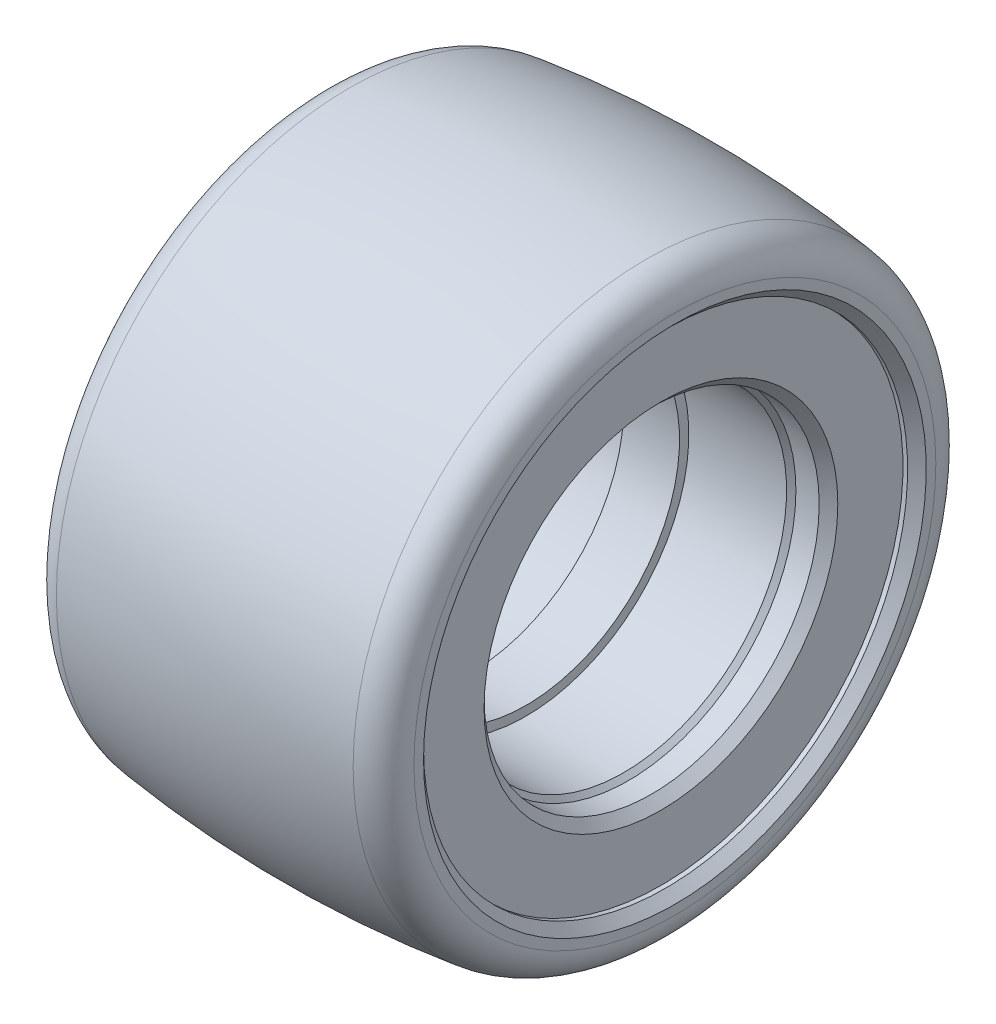
ISO-10303-21;
HEADER;
FILE_DESCRIPTION(('STEP AP214'),'2;1');
FILE_NAME('part.step','',(''),(''),'','','');
FILE_SCHEMA(('AUTOMOTIVE_DESIGN { 1 0 10303 214 1 1 1 1 }'));
ENDSEC;
DATA;
#1=APPLICATION_CONTEXT('core data for automotive mechanical design processes');
#2=APPLICATION_PROTOCOL_DEFINITION('international standard','automotive_design',2000,#1);
#3=PRODUCT_CONTEXT('',#1,'mechanical');
#4=PRODUCT('Part','Part','',(#3));
#5=PRODUCT_RELATED_PRODUCT_CATEGORY('part','',(#4));
#6=PRODUCT_DEFINITION_FORMATION('','',#4);
#7=PRODUCT_DEFINITION_CONTEXT('part definition',#1,'design');
#8=PRODUCT_DEFINITION('design','',#6,#7);
#9=PRODUCT_DEFINITION_SHAPE('','',#8);
#10=(LENGTH_UNIT() NAMED_UNIT(*) SI_UNIT(.MILLI.,.METRE.));
#11=(NAMED_UNIT(*) PLANE_ANGLE_UNIT() SI_UNIT($,.RADIAN.));
#12=(NAMED_UNIT(*) SI_UNIT($,.STERADIAN.) SOLID_ANGLE_UNIT());
#13=UNCERTAINTY_MEASURE_WITH_UNIT(LENGTH_MEASURE(1.E-05),#10,'distance_accuracy_value','');
#14=(GEOMETRIC_REPRESENTATION_CONTEXT(3) GLOBAL_UNCERTAINTY_ASSIGNED_CONTEXT((#13)) GLOBAL_UNIT_ASSIGNED_CONTEXT((#10,
#11,#12)) REPRESENTATION_CONTEXT('',''));
#15=CARTESIAN_POINT('',(0.,0.,0.));
#16=DIRECTION('',(0.,0.,1.));
#17=DIRECTION('',(1.,0.,0.));
#18=AXIS2_PLACEMENT_3D('',#15,#16,#17);
#19=CARTESIAN_POINT('',(19.,0.,0.));
#20=DIRECTION('',(-1.,0.,0.));
#21=DIRECTION('',(0.,0.,1.));
#22=AXIS2_PLACEMENT_3D('',#19,#20,#21);
#23=PLANE('',#22);
#24=CARTESIAN_POINT('',(19.,0.,0.));
#25=DIRECTION('',(-1.,0.,0.));
#26=DIRECTION('',(0.,0.,1.));
#27=AXIS2_PLACEMENT_3D('',#24,#25,#26);
#28=CIRCLE('',#27,28.0274359645035);
#29=CARTESIAN_POINT('',(19.,0.,28.0274359645035));
#30=VERTEX_POINT('',#29);
#31=EDGE_CURVE('E10',#30,#30,#28,.F.);
#32=ORIENTED_EDGE('',*,*,#31,.T.);
#33=EDGE_LOOP('',(#32));
#34=FACE_BOUND('',#33,.T.);
#35=CARTESIAN_POINT('',(19.,0.,0.));
#36=DIRECTION('',(-1.,0.,0.));
#37=DIRECTION('',(0.,0.,1.));
#38=AXIS2_PLACEMENT_3D('',#35,#36,#37);
#39=CIRCLE('',#38,27.);
#40=CARTESIAN_POINT('',(19.,0.,27.));
#41=VERTEX_POINT('',#40);
#42=EDGE_CURVE('E63',#41,#41,#39,.T.);
#43=ORIENTED_EDGE('',*,*,#42,.T.);
#44=EDGE_LOOP('',(#43));
#45=FACE_BOUND('',#44,.T.);
#46=ADVANCED_FACE('F34',(#34,#45),#23,.F.);
#47=CARTESIAN_POINT('',(-19.,0.,0.));
#48=DIRECTION('',(-1.,0.,0.));
#49=DIRECTION('',(0.,0.,1.));
#50=AXIS2_PLACEMENT_3D('',#47,#48,#49);
#51=PLANE('',#50);
#52=CARTESIAN_POINT('',(-19.,0.,0.));
#53=DIRECTION('',(-1.,0.,0.));
#54=DIRECTION('',(0.,0.,1.));
#55=AXIS2_PLACEMENT_3D('',#52,#53,#54);
#56=CIRCLE('',#55,28.0274359645035);
#57=CARTESIAN_POINT('',(-19.,0.,28.0274359645035));
#58=VERTEX_POINT('',#57);
#59=EDGE_CURVE('E49',#58,#58,#56,.T.);
#60=ORIENTED_EDGE('',*,*,#59,.T.);
#61=EDGE_LOOP('',(#60));
#62=FACE_BOUND('',#61,.T.);
#63=CARTESIAN_POINT('',(-19.,0.,0.));
#64=DIRECTION('',(-1.,0.,0.));
#65=DIRECTION('',(0.,0.,1.));
#66=AXIS2_PLACEMENT_3D('',#63,#64,#65);
#67=CIRCLE('',#66,27.);
#68=CARTESIAN_POINT('',(-19.,0.,27.));
#69=VERTEX_POINT('',#68);
#70=EDGE_CURVE('E72',#69,#69,#67,.F.);
#71=ORIENTED_EDGE('',*,*,#70,.T.);
#72=EDGE_LOOP('',(#71));
#73=FACE_BOUND('',#72,.T.);
#74=ADVANCED_FACE('F127',(#62,#73),#51,.T.);
#75=CARTESIAN_POINT('',(-17.6,0.,0.));
#76=DIRECTION('',(-1.,0.,0.));
#77=DIRECTION('',(0.,0.,1.));
#78=AXIS2_PLACEMENT_3D('',#75,#76,#77);
#79=CYLINDRICAL_SURFACE('',#78,26.);
#80=CARTESIAN_POINT('',(-18.,0.,0.));
#81=DIRECTION('',(-1.,0.,0.));
#82=DIRECTION('',(0.,0.,1.));
#83=AXIS2_PLACEMENT_3D('',#80,#81,#82);
#84=CIRCLE('',#83,26.);
#85=CARTESIAN_POINT('',(-18.,0.,26.));
#86=VERTEX_POINT('',#85);
#87=EDGE_CURVE('E75',#86,#86,#84,.T.);
#88=ORIENTED_EDGE('',*,*,#87,.T.);
#89=EDGE_LOOP('',(#88));
#90=FACE_BOUND('',#89,.T.);
#91=CARTESIAN_POINT('',(-17.5,0.,0.));
#92=DIRECTION('',(-1.,0.,0.));
#93=DIRECTION('',(0.,0.,1.));
#94=AXIS2_PLACEMENT_3D('',#91,#92,#93);
#95=CIRCLE('',#94,26.);
#96=CARTESIAN_POINT('',(-17.5,0.,26.));
#97=VERTEX_POINT('',#96);
#98=EDGE_CURVE('E84',#97,#97,#95,.T.);
#99=ORIENTED_EDGE('',*,*,#98,.F.);
#100=EDGE_LOOP('',(#99));
#101=FACE_BOUND('',#100,.T.);
#102=ADVANCED_FACE('F132',(#90,#101),#79,.F.);
#103=CARTESIAN_POINT('',(-17.5,0.,0.));
#104=DIRECTION('',(-1.,0.,0.));
#105=DIRECTION('',(0.,0.,1.));
#106=AXIS2_PLACEMENT_3D('',#103,#104,#105);
#107=PLANE('',#106);
#108=CARTESIAN_POINT('',(-17.5,0.,0.));
#109=DIRECTION('',(-1.,0.,0.));
#110=DIRECTION('',(0.,0.,1.));
#111=AXIS2_PLACEMENT_3D('',#108,#109,#110);
#112=CIRCLE('',#111,19.);
#113=CARTESIAN_POINT('',(-17.5,0.,19.));
#114=VERTEX_POINT('',#113);
#115=EDGE_CURVE('E78',#114,#114,#112,.F.);
#116=ORIENTED_EDGE('',*,*,#115,.T.);
#117=EDGE_LOOP('',(#116));
#118=FACE_BOUND('',#117,.T.);
#119=ORIENTED_EDGE('',*,*,#98,.T.);
#120=EDGE_LOOP('',(#119));
#121=FACE_BOUND('',#120,.T.);
#122=ADVANCED_FACE('F180',(#118,#121),#107,.T.);
#123=CARTESIAN_POINT('',(-17.6,0.,0.));
#124=DIRECTION('',(-1.,0.,0.));
#125=DIRECTION('',(0.,0.,1.));
#126=AXIS2_PLACEMENT_3D('',#123,#124,#125);
#127=CYLINDRICAL_SURFACE('',#126,18.);
#128=CARTESIAN_POINT('',(-16.5,0.,0.));
#129=DIRECTION('',(-1.,0.,0.));
#130=DIRECTION('',(0.,0.,1.));
#131=AXIS2_PLACEMENT_3D('',#128,#129,#130);
#132=CIRCLE('',#131,18.);
#133=CARTESIAN_POINT('',(-16.5,0.,18.));
#134=VERTEX_POINT('',#133);
#135=EDGE_CURVE('E81',#134,#134,#132,.T.);
#136=ORIENTED_EDGE('',*,*,#135,.T.);
#137=EDGE_LOOP('',(#136));
#138=FACE_BOUND('',#137,.T.);
#139=CARTESIAN_POINT('',(-14.,0.,0.));
#140=DIRECTION('',(-1.,0.,0.));
#141=DIRECTION('',(0.,0.,1.));
#142=AXIS2_PLACEMENT_3D('',#139,#140,#141);
#143=CIRCLE('',#142,18.);
#144=CARTESIAN_POINT('',(-14.,0.,18.));
#145=VERTEX_POINT('',#144);
#146=EDGE_CURVE('E87',#145,#145,#143,.T.);
#147=ORIENTED_EDGE('',*,*,#146,.F.);
#148=EDGE_LOOP('',(#147));
#149=FACE_BOUND('',#148,.T.);
#150=ADVANCED_FACE('F184',(#138,#149),#127,.F.);
#151=CARTESIAN_POINT('',(-17.6,0.,0.));
#152=DIRECTION('',(-1.,0.,0.));
#153=DIRECTION('',(0.,0.,1.));
#154=AXIS2_PLACEMENT_3D('',#151,#152,#153);
#155=CYLINDRICAL_SURFACE('',#154,17.5);
#156=CARTESIAN_POINT('',(-13.5,0.,0.));
#157=DIRECTION('',(-1.,0.,0.));
#158=DIRECTION('',(0.,0.,1.));
#159=AXIS2_PLACEMENT_3D('',#156,#157,#158);
#160=CIRCLE('',#159,17.5);
#161=CARTESIAN_POINT('',(-13.5,0.,17.5));
#162=VERTEX_POINT('',#161);
#163=EDGE_CURVE('E57',#162,#162,#160,.T.);
#164=ORIENTED_EDGE('',*,*,#163,.T.);
#165=EDGE_LOOP('',(#164));
#166=FACE_BOUND('',#165,.T.);
#167=CARTESIAN_POINT('',(-3.,0.,0.));
#168=DIRECTION('',(-1.,0.,0.));
#169=DIRECTION('',(0.,0.,1.));
#170=AXIS2_PLACEMENT_3D('',#167,#168,#169);
#171=CIRCLE('',#170,17.5);
#172=CARTESIAN_POINT('',(-3.,0.,17.5));
#173=VERTEX_POINT('',#172);
#174=EDGE_CURVE('E90',#173,#173,#171,.T.);
#175=ORIENTED_EDGE('',*,*,#174,.F.);
#176=EDGE_LOOP('',(#175));
#177=FACE_BOUND('',#176,.T.);
#178=ADVANCED_FACE('F188',(#166,#177),#155,.F.);
#179=CARTESIAN_POINT('',(-3.,0.,0.));
#180=DIRECTION('',(1.,0.,0.));
#181=DIRECTION('',(0.,0.,-1.));
#182=AXIS2_PLACEMENT_3D('',#179,#180,#181);
#183=PLANE('',#182);
#184=CARTESIAN_POINT('',(-3.,0.,0.));
#185=DIRECTION('',(-1.,0.,0.));
#186=DIRECTION('',(0.,0.,1.));
#187=AXIS2_PLACEMENT_3D('',#184,#185,#186);
#188=CIRCLE('',#187,16.5);
#189=CARTESIAN_POINT('',(-3.,0.,16.5));
#190=VERTEX_POINT('',#189);
#191=EDGE_CURVE('E93',#190,#190,#188,.T.);
#192=ORIENTED_EDGE('',*,*,#191,.F.);
#193=EDGE_LOOP('',(#192));
#194=FACE_BOUND('',#193,.T.);
#195=ORIENTED_EDGE('',*,*,#174,.T.);
#196=EDGE_LOOP('',(#195));
#197=FACE_BOUND('',#196,.T.);
#198=ADVANCED_FACE('F192',(#194,#197),#183,.F.);
#199=CARTESIAN_POINT('',(-17.6,0.,0.));
#200=DIRECTION('',(-1.,0.,0.));
#201=DIRECTION('',(0.,0.,1.));
#202=AXIS2_PLACEMENT_3D('',#199,#200,#201);
#203=CYLINDRICAL_SURFACE('',#202,16.5);
#204=CARTESIAN_POINT('',(3.,0.,0.));
#205=DIRECTION('',(-1.,0.,0.));
#206=DIRECTION('',(0.,0.,1.));
#207=AXIS2_PLACEMENT_3D('',#204,#205,#206);
#208=CIRCLE('',#207,16.5);
#209=CARTESIAN_POINT('',(3.,0.,16.5));
#210=VERTEX_POINT('',#209);
#211=EDGE_CURVE('E96',#210,#210,#208,.T.);
#212=ORIENTED_EDGE('',*,*,#211,.F.);
#213=EDGE_LOOP('',(#212));
#214=FACE_BOUND('',#213,.T.);
#215=ORIENTED_EDGE('',*,*,#191,.T.);
#216=EDGE_LOOP('',(#215));
#217=FACE_BOUND('',#216,.T.);
#218=ADVANCED_FACE('F196',(#214,#217),#203,.F.);
#219=CARTESIAN_POINT('',(3.,0.,0.));
#220=DIRECTION('',(-1.,0.,0.));
#221=DIRECTION('',(0.,0.,1.));
#222=AXIS2_PLACEMENT_3D('',#219,#220,#221);
#223=PLANE('',#222);
#224=CARTESIAN_POINT('',(3.,0.,0.));
#225=DIRECTION('',(-1.,0.,0.));
#226=DIRECTION('',(0.,0.,1.));
#227=AXIS2_PLACEMENT_3D('',#224,#225,#226);
#228=CIRCLE('',#227,17.5);
#229=CARTESIAN_POINT('',(3.,0.,17.5));
#230=VERTEX_POINT('',#229);
#231=EDGE_CURVE('E99',#230,#230,#228,.T.);
#232=ORIENTED_EDGE('',*,*,#231,.F.);
#233=EDGE_LOOP('',(#232));
#234=FACE_BOUND('',#233,.T.);
#235=ORIENTED_EDGE('',*,*,#211,.T.);
#236=EDGE_LOOP('',(#235));
#237=FACE_BOUND('',#236,.T.);
#238=ADVANCED_FACE('F200',(#234,#237),#223,.F.);
#239=CARTESIAN_POINT('',(-17.6,0.,0.));
#240=DIRECTION('',(-1.,0.,0.));
#241=DIRECTION('',(0.,0.,1.));
#242=AXIS2_PLACEMENT_3D('',#239,#240,#241);
#243=CYLINDRICAL_SURFACE('',#242,17.5);
#244=CARTESIAN_POINT('',(13.5,0.,0.));
#245=DIRECTION('',(-1.,0.,0.));
#246=DIRECTION('',(0.,0.,1.));
#247=AXIS2_PLACEMENT_3D('',#244,#245,#246);
#248=CIRCLE('',#247,17.5);
#249=CARTESIAN_POINT('',(13.5,0.,17.5));
#250=VERTEX_POINT('',#249);
#251=EDGE_CURVE('E54',#250,#250,#248,.F.);
#252=ORIENTED_EDGE('',*,*,#251,.T.);
#253=EDGE_LOOP('',(#252));
#254=FACE_BOUND('',#253,.T.);
#255=ORIENTED_EDGE('',*,*,#231,.T.);
#256=EDGE_LOOP('',(#255));
#257=FACE_BOUND('',#256,.T.);
#258=ADVANCED_FACE('F123',(#254,#257),#243,.F.);
#259=CARTESIAN_POINT('',(-17.6,0.,0.));
#260=DIRECTION('',(-1.,0.,0.));
#261=DIRECTION('',(0.,0.,1.));
#262=AXIS2_PLACEMENT_3D('',#259,#260,#261);
#263=CYLINDRICAL_SURFACE('',#262,18.);
#264=CARTESIAN_POINT('',(16.5,0.,0.));
#265=DIRECTION('',(-1.,0.,0.));
#266=DIRECTION('',(0.,0.,1.));
#267=AXIS2_PLACEMENT_3D('',#264,#265,#266);
#268=CIRCLE('',#267,18.);
#269=CARTESIAN_POINT('',(16.5,0.,18.));
#270=VERTEX_POINT('',#269);
#271=EDGE_CURVE('E66',#270,#270,#268,.F.);
#272=ORIENTED_EDGE('',*,*,#271,.T.);
#273=EDGE_LOOP('',(#272));
#274=FACE_BOUND('',#273,.T.);
#275=CARTESIAN_POINT('',(14.,0.,0.));
#276=DIRECTION('',(-1.,0.,0.));
#277=DIRECTION('',(0.,0.,1.));
#278=AXIS2_PLACEMENT_3D('',#275,#276,#277);
#279=CIRCLE('',#278,18.);
#280=CARTESIAN_POINT('',(14.,0.,18.));
#281=VERTEX_POINT('',#280);
#282=EDGE_CURVE('E102',#281,#281,#279,.T.);
#283=ORIENTED_EDGE('',*,*,#282,.T.);
#284=EDGE_LOOP('',(#283));
#285=FACE_BOUND('',#284,.T.);
#286=ADVANCED_FACE('F113',(#274,#285),#263,.F.);
#287=CARTESIAN_POINT('',(17.5,0.,0.));
#288=DIRECTION('',(-1.,0.,0.));
#289=DIRECTION('',(0.,0.,1.));
#290=AXIS2_PLACEMENT_3D('',#287,#288,#289);
#291=PLANE('',#290);
#292=CARTESIAN_POINT('',(17.5,0.,0.));
#293=DIRECTION('',(-1.,0.,0.));
#294=DIRECTION('',(0.,0.,1.));
#295=AXIS2_PLACEMENT_3D('',#292,#293,#294);
#296=CIRCLE('',#295,19.);
#297=CARTESIAN_POINT('',(17.5,0.,19.));
#298=VERTEX_POINT('',#297);
#299=EDGE_CURVE('E69',#298,#298,#296,.T.);
#300=ORIENTED_EDGE('',*,*,#299,.T.);
#301=EDGE_LOOP('',(#300));
#302=FACE_BOUND('',#301,.T.);
#303=CARTESIAN_POINT('',(17.5,0.,0.));
#304=DIRECTION('',(-1.,0.,0.));
#305=DIRECTION('',(0.,0.,1.));
#306=AXIS2_PLACEMENT_3D('',#303,#304,#305);
#307=CIRCLE('',#306,26.);
#308=CARTESIAN_POINT('',(17.5,0.,26.));
#309=VERTEX_POINT('',#308);
#310=EDGE_CURVE('E105',#309,#309,#307,.T.);
#311=ORIENTED_EDGE('',*,*,#310,.F.);
#312=EDGE_LOOP('',(#311));
#313=FACE_BOUND('',#312,.T.);
#314=ADVANCED_FACE('F111',(#302,#313),#291,.F.);
#315=CARTESIAN_POINT('',(-17.6,0.,0.));
#316=DIRECTION('',(-1.,0.,0.));
#317=DIRECTION('',(0.,0.,1.));
#318=AXIS2_PLACEMENT_3D('',#315,#316,#317);
#319=CYLINDRICAL_SURFACE('',#318,26.);
#320=CARTESIAN_POINT('',(18.,0.,0.));
#321=DIRECTION('',(-1.,0.,0.));
#322=DIRECTION('',(0.,0.,1.));
#323=AXIS2_PLACEMENT_3D('',#320,#321,#322);
#324=CIRCLE('',#323,26.);
#325=CARTESIAN_POINT('',(18.,0.,26.));
#326=VERTEX_POINT('',#325);
#327=EDGE_CURVE('E60',#326,#326,#324,.F.);
#328=ORIENTED_EDGE('',*,*,#327,.T.);
#329=EDGE_LOOP('',(#328));
#330=FACE_BOUND('',#329,.T.);
#331=ORIENTED_EDGE('',*,*,#310,.T.);
#332=EDGE_LOOP('',(#331));
#333=FACE_BOUND('',#332,.T.);
#334=ADVANCED_FACE('F109',(#330,#333),#319,.F.);
#335=CARTESIAN_POINT('',(0.,0.,0.));
#336=DIRECTION('',(-1.,0.,0.));
#337=DIRECTION('',(0.,0.,1.));
#338=AXIS2_PLACEMENT_3D('',#335,#336,#337);
#339=DEGENERATE_TOROIDAL_SURFACE('',#338,95.,127.5,.F.);
#340=CARTESIAN_POINT('',(-15.9375,0.,0.));
#341=DIRECTION('',(1.,0.,0.));
#342=DIRECTION('',(0.,0.,-1.));
#343=AXIS2_PLACEMENT_3D('',#340,#341,#342);
#344=CIRCLE('',#343,31.4999845602757);
#345=CARTESIAN_POINT('',(-15.9375,0.,-31.4999845602757));
#346=VERTEX_POINT('',#345);
#347=EDGE_CURVE('E41',#346,#346,#344,.T.);
#348=ORIENTED_EDGE('',*,*,#347,.T.);
#349=EDGE_LOOP('',(#348));
#350=FACE_BOUND('',#349,.T.);
#351=CARTESIAN_POINT('',(15.9375,0.,0.));
#352=DIRECTION('',(-1.,0.,0.));
#353=DIRECTION('',(0.,0.,1.));
#354=AXIS2_PLACEMENT_3D('',#351,#352,#353);
#355=CIRCLE('',#354,31.4999845602757);
#356=CARTESIAN_POINT('',(15.9375,0.,31.4999845602757));
#357=VERTEX_POINT('',#356);
#358=EDGE_CURVE('E45',#357,#357,#355,.T.);
#359=ORIENTED_EDGE('',*,*,#358,.T.);
#360=EDGE_LOOP('',(#359));
#361=FACE_BOUND('',#360,.T.);
#362=ADVANCED_FACE('F120',(#350,#361),#339,.F.);
#363=CARTESIAN_POINT('',(-16.5,0.,0.));
#364=DIRECTION('',(-1.,0.,0.));
#365=DIRECTION('',(0.,0.,1.));
#366=AXIS2_PLACEMENT_3D('',#363,#364,#365);
#367=CONICAL_SURFACE('',#366,18.,0.785398163397459);
#368=ORIENTED_EDGE('',*,*,#115,.F.);
#369=EDGE_LOOP('',(#368));
#370=FACE_BOUND('',#369,.T.);
#371=ORIENTED_EDGE('',*,*,#135,.F.);
#372=EDGE_LOOP('',(#371));
#373=FACE_BOUND('',#372,.T.);
#374=ADVANCED_FACE('F138',(#370,#373),#367,.F.);
#375=CARTESIAN_POINT('',(-18.,0.,0.));
#376=DIRECTION('',(-1.,0.,0.));
#377=DIRECTION('',(0.,0.,1.));
#378=AXIS2_PLACEMENT_3D('',#375,#376,#377);
#379=CONICAL_SURFACE('',#378,26.,0.78539816339745);
#380=ORIENTED_EDGE('',*,*,#70,.F.);
#381=EDGE_LOOP('',(#380));
#382=FACE_BOUND('',#381,.T.);
#383=ORIENTED_EDGE('',*,*,#87,.F.);
#384=EDGE_LOOP('',(#383));
#385=FACE_BOUND('',#384,.T.);
#386=ADVANCED_FACE('F142',(#382,#385),#379,.F.);
#387=CARTESIAN_POINT('',(17.5,0.,0.));
#388=DIRECTION('',(1.,0.,0.));
#389=DIRECTION('',(0.,0.,-1.));
#390=AXIS2_PLACEMENT_3D('',#387,#388,#389);
#391=CONICAL_SURFACE('',#390,19.,0.785398163397448);
#392=ORIENTED_EDGE('',*,*,#271,.F.);
#393=EDGE_LOOP('',(#392));
#394=FACE_BOUND('',#393,.T.);
#395=ORIENTED_EDGE('',*,*,#299,.F.);
#396=EDGE_LOOP('',(#395));
#397=FACE_BOUND('',#396,.T.);
#398=ADVANCED_FACE('F170',(#394,#397),#391,.F.);
#399=CARTESIAN_POINT('',(19.,0.,0.));
#400=DIRECTION('',(1.,0.,0.));
#401=DIRECTION('',(0.,0.,-1.));
#402=AXIS2_PLACEMENT_3D('',#399,#400,#401);
#403=CONICAL_SURFACE('',#402,27.,0.785398163397443);
#404=ORIENTED_EDGE('',*,*,#327,.F.);
#405=EDGE_LOOP('',(#404));
#406=FACE_BOUND('',#405,.T.);
#407=ORIENTED_EDGE('',*,*,#42,.F.);
#408=EDGE_LOOP('',(#407));
#409=FACE_BOUND('',#408,.T.);
#410=ADVANCED_FACE('F166',(#406,#409),#403,.F.);
#411=CARTESIAN_POINT('',(-13.5,0.,0.));
#412=DIRECTION('',(-1.,0.,0.));
#413=DIRECTION('',(0.,0.,1.));
#414=AXIS2_PLACEMENT_3D('',#411,#412,#413);
#415=CONICAL_SURFACE('',#414,17.5,0.785398163397455);
#416=ORIENTED_EDGE('',*,*,#146,.T.);
#417=EDGE_LOOP('',(#416));
#418=FACE_BOUND('',#417,.T.);
#419=ORIENTED_EDGE('',*,*,#163,.F.);
#420=EDGE_LOOP('',(#419));
#421=FACE_BOUND('',#420,.T.);
#422=ADVANCED_FACE('F159',(#418,#421),#415,.F.);
#423=CARTESIAN_POINT('',(14.,0.,0.));
#424=DIRECTION('',(1.,0.,0.));
#425=DIRECTION('',(0.,0.,-1.));
#426=AXIS2_PLACEMENT_3D('',#423,#424,#425);
#427=CONICAL_SURFACE('',#426,18.,0.785398163397441);
#428=ORIENTED_EDGE('',*,*,#251,.F.);
#429=EDGE_LOOP('',(#428));
#430=FACE_BOUND('',#429,.T.);
#431=ORIENTED_EDGE('',*,*,#282,.F.);
#432=EDGE_LOOP('',(#431));
#433=FACE_BOUND('',#432,.T.);
#434=ADVANCED_FACE('F154',(#430,#433),#427,.F.);
#435=CARTESIAN_POINT('',(-15.5,0.,0.));
#436=DIRECTION('',(-1.,0.,0.));
#437=DIRECTION('',(0.,0.,1.));
#438=AXIS2_PLACEMENT_3D('',#435,#436,#437);
#439=TOROIDAL_SURFACE('',#438,28.0274359645035,3.5);
#440=ORIENTED_EDGE('',*,*,#347,.F.);
#441=EDGE_LOOP('',(#440));
#442=FACE_BOUND('',#441,.T.);
#443=ORIENTED_EDGE('',*,*,#59,.F.);
#444=EDGE_LOOP('',(#443));
#445=FACE_BOUND('',#444,.T.);
#446=ADVANCED_FACE('F149',(#442,#445),#439,.T.);
#447=CARTESIAN_POINT('',(15.5,0.,0.));
#448=DIRECTION('',(-1.,0.,0.));
#449=DIRECTION('',(0.,0.,1.));
#450=AXIS2_PLACEMENT_3D('',#447,#448,#449);
#451=TOROIDAL_SURFACE('',#450,28.0274359645035,3.5);
#452=ORIENTED_EDGE('',*,*,#31,.F.);
#453=EDGE_LOOP('',(#452));
#454=FACE_BOUND('',#453,.T.);
#455=ORIENTED_EDGE('',*,*,#358,.F.);
#456=EDGE_LOOP('',(#455));
#457=FACE_BOUND('',#456,.T.);
#458=ADVANCED_FACE('F36',(#454,#457),#451,.T.);
#459=CLOSED_SHELL('',(#46,#74,#102,#122,#150,#178,#198,#218,#238,#258,#286,#314,#334,#362,#374,
#386,#398,#410,#422,#434,#446,#458));
#460=MANIFOLD_SOLID_BREP('B2',#459);
#461=ADVANCED_BREP_SHAPE_REPRESENTATION('',(#18,#460),#14);
#462=SHAPE_DEFINITION_REPRESENTATION(#9,#461);
ENDSEC;
END-ISO-10303-21;
